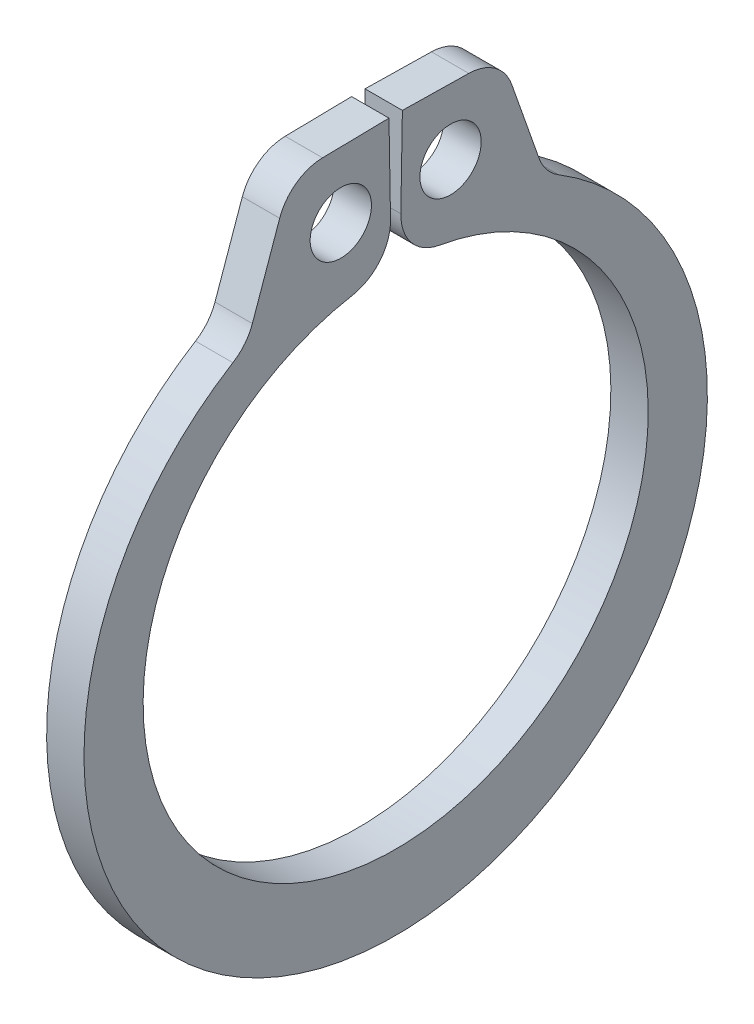
ISO-10303-21;
HEADER;
FILE_DESCRIPTION(('STEP AP214'),'2;1');
FILE_NAME('part.step','',(''),(''),'','','');
FILE_SCHEMA(('AUTOMOTIVE_DESIGN { 1 0 10303 214 1 1 1 1 }'));
ENDSEC;
DATA;
#1=APPLICATION_CONTEXT('core data for automotive mechanical design processes');
#2=APPLICATION_PROTOCOL_DEFINITION('international standard','automotive_design',2000,#1);
#3=PRODUCT_CONTEXT('',#1,'mechanical');
#4=PRODUCT('Part','Part','',(#3));
#5=PRODUCT_RELATED_PRODUCT_CATEGORY('part','',(#4));
#6=PRODUCT_DEFINITION_FORMATION('','',#4);
#7=PRODUCT_DEFINITION_CONTEXT('part definition',#1,'design');
#8=PRODUCT_DEFINITION('design','',#6,#7);
#9=PRODUCT_DEFINITION_SHAPE('','',#8);
#10=(LENGTH_UNIT() NAMED_UNIT(*) SI_UNIT(.MILLI.,.METRE.));
#11=(NAMED_UNIT(*) PLANE_ANGLE_UNIT() SI_UNIT($,.RADIAN.));
#12=(NAMED_UNIT(*) SI_UNIT($,.STERADIAN.) SOLID_ANGLE_UNIT());
#13=UNCERTAINTY_MEASURE_WITH_UNIT(LENGTH_MEASURE(1.E-05),#10,'distance_accuracy_value','');
#14=(GEOMETRIC_REPRESENTATION_CONTEXT(3) GLOBAL_UNCERTAINTY_ASSIGNED_CONTEXT((#13)) GLOBAL_UNIT_ASSIGNED_CONTEXT((#10,
#11,#12)) REPRESENTATION_CONTEXT('',''));
#15=CARTESIAN_POINT('',(0.,0.,0.));
#16=DIRECTION('',(0.,0.,1.));
#17=DIRECTION('',(1.,0.,0.));
#18=AXIS2_PLACEMENT_3D('',#15,#16,#17);
#19=CARTESIAN_POINT('',(0.3175,-0.264524901465114,0.));
#20=DIRECTION('',(1.,0.,0.));
#21=DIRECTION('',(0.,0.,-1.));
#22=AXIS2_PLACEMENT_3D('',#19,#20,#21);
#23=PLANE('',#22);
#24=CARTESIAN_POINT('',(0.3175,5.39474739325938,0.932493347387079));
#25=DIRECTION('',(1.,0.,0.));
#26=DIRECTION('',(0.,0.,-1.));
#27=AXIS2_PLACEMENT_3D('',#24,#25,#26);
#28=CIRCLE('',#27,0.5207);
#29=CARTESIAN_POINT('',(0.3175,5.39474739325938,0.411793347387079));
#30=VERTEX_POINT('',#29);
#31=EDGE_CURVE('E179',#30,#30,#28,.T.);
#32=ORIENTED_EDGE('',*,*,#31,.F.);
#33=EDGE_LOOP('',(#32));
#34=FACE_BOUND('',#33,.T.);
#35=DIRECTION('',(0.,0.943255355198257,0.332068268417521));
#36=VECTOR('',#35,1.);
#37=CARTESIAN_POINT('',(0.3175,6.49754857029043,-1.79007049490147));
#38=LINE('',#37,#36);
#39=CARTESIAN_POINT('',(0.3175,4.66344515220108,-2.43575731002226));
#40=VERTEX_POINT('',#39);
#41=CARTESIAN_POINT('',(0.3175,5.98129100900124,-1.97181635352819));
#42=VERTEX_POINT('',#41);
#43=EDGE_CURVE('E185',#40,#42,#38,.T.);
#44=ORIENTED_EDGE('',*,*,#43,.T.);
#45=CARTESIAN_POINT('',(0.3175,5.71982045444928,-1.22909708684508));
#46=DIRECTION('',(1.,0.,0.));
#47=DIRECTION('',(0.,0.,-1.));
#48=AXIS2_PLACEMENT_3D('',#45,#46,#47);
#49=CIRCLE('',#48,0.7874);
#50=CARTESIAN_POINT('',(0.3175,6.50710052961543,-1.2428391116738));
#51=VERTEX_POINT('',#50);
#52=EDGE_CURVE('E224',#42,#51,#49,.T.);
#53=ORIENTED_EDGE('',*,*,#52,.T.);
#54=DIRECTION('',(0.,0.0174524064372838,0.999847695156391));
#55=VECTOR('',#54,1.);
#56=CARTESIAN_POINT('',(0.3175,6.52680578444189,-0.113925818741299));
#57=LINE('',#56,#55);
#58=CARTESIAN_POINT('',(0.3175,6.52680578444189,-0.113925818741299));
#59=VERTEX_POINT('',#58);
#60=EDGE_CURVE('E188',#51,#59,#57,.T.);
#61=ORIENTED_EDGE('',*,*,#60,.T.);
#62=DIRECTION('',(0.,-0.999847695156391,0.0174524064372837));
#63=VECTOR('',#62,1.);
#64=CARTESIAN_POINT('',(0.3175,4.29194621622833,-0.0749161998726827));
#65=LINE('',#64,#63);
#66=CARTESIAN_POINT('',(0.3175,5.01784114958208,-0.0875867430654367));
#67=VERTEX_POINT('',#66);
#68=EDGE_CURVE('E156',#59,#67,#65,.T.);
#69=ORIENTED_EDGE('',*,*,#68,.T.);
#70=CARTESIAN_POINT('',(0.3175,5.00409912475336,-0.874866818231579));
#71=DIRECTION('',(1.,0.,0.));
#72=DIRECTION('',(0.,0.,-1.));
#73=AXIS2_PLACEMENT_3D('',#70,#71,#72);
#74=CIRCLE('',#73,0.7874);
#75=CARTESIAN_POINT('',(0.3175,4.22846376041659,-0.739262461405685));
#76=VERTEX_POINT('',#75);
#77=EDGE_CURVE('E222',#67,#76,#74,.T.);
#78=ORIENTED_EDGE('',*,*,#77,.T.);
#79=CARTESIAN_POINT('',(0.3175,0.,0.));
#80=DIRECTION('',(-1.,0.,0.));
#81=DIRECTION('',(0.,0.,-1.));
#82=AXIS2_PLACEMENT_3D('',#79,#80,#81);
#83=CIRCLE('',#82,4.2926);
#84=CARTESIAN_POINT('',(0.3175,4.22846376041659,0.739262461405685));
#85=VERTEX_POINT('',#84);
#86=EDGE_CURVE('E191',#76,#85,#83,.T.);
#87=ORIENTED_EDGE('',*,*,#86,.T.);
#88=CARTESIAN_POINT('',(0.3175,5.00409912475336,0.874866818231579));
#89=DIRECTION('',(1.,0.,0.));
#90=DIRECTION('',(0.,0.,-1.));
#91=AXIS2_PLACEMENT_3D('',#88,#89,#90);
#92=CIRCLE('',#91,0.7874);
#93=CARTESIAN_POINT('',(0.3175,5.01784114958208,0.087586743065437));
#94=VERTEX_POINT('',#93);
#95=EDGE_CURVE('E220',#85,#94,#92,.T.);
#96=ORIENTED_EDGE('',*,*,#95,.T.);
#97=DIRECTION('',(0.,0.999847695156391,0.0174524064372835));
#98=VECTOR('',#97,1.);
#99=CARTESIAN_POINT('',(0.3175,4.29194621622833,0.0749161998726831));
#100=LINE('',#99,#98);
#101=CARTESIAN_POINT('',(0.3175,6.52680578444189,0.113925818741299));
#102=VERTEX_POINT('',#101);
#103=EDGE_CURVE('E194',#94,#102,#100,.T.);
#104=ORIENTED_EDGE('',*,*,#103,.T.);
#105=DIRECTION('',(0.,-0.0174524064372838,0.999847695156391));
#106=VECTOR('',#105,1.);
#107=CARTESIAN_POINT('',(0.3175,6.52680578444189,0.113925818741299));
#108=LINE('',#107,#106);
#109=CARTESIAN_POINT('',(0.3175,6.50710052961543,1.2428391116738));
#110=VERTEX_POINT('',#109);
#111=EDGE_CURVE('E196',#102,#110,#108,.T.);
#112=ORIENTED_EDGE('',*,*,#111,.T.);
#113=CARTESIAN_POINT('',(0.3175,5.71982045444928,1.22909708684508));
#114=DIRECTION('',(1.,0.,0.));
#115=DIRECTION('',(0.,0.,-1.));
#116=AXIS2_PLACEMENT_3D('',#113,#114,#115);
#117=CIRCLE('',#116,0.7874);
#118=CARTESIAN_POINT('',(0.3175,5.98129100900124,1.97181635352819));
#119=VERTEX_POINT('',#118);
#120=EDGE_CURVE('E57',#110,#119,#117,.T.);
#121=ORIENTED_EDGE('',*,*,#120,.T.);
#122=DIRECTION('',(0.,-0.943255355198257,0.33206826841752));
#123=VECTOR('',#122,1.);
#124=CARTESIAN_POINT('',(0.3175,6.49754857029043,1.79007049490147));
#125=LINE('',#124,#123);
#126=CARTESIAN_POINT('',(0.3175,4.66344515220108,2.43575731002226));
#127=VERTEX_POINT('',#126);
#128=EDGE_CURVE('E198',#119,#127,#125,.T.);
#129=ORIENTED_EDGE('',*,*,#128,.T.);
#130=CARTESIAN_POINT('',(0.3175,4.92491570675304,3.17847657670536));
#131=DIRECTION('',(1.,0.,0.));
#132=DIRECTION('',(0.,0.,-1.));
#133=AXIS2_PLACEMENT_3D('',#130,#131,#132);
#134=CIRCLE('',#133,0.7874);
#135=CARTESIAN_POINT('',(0.3175,4.25345366496525,2.76721329553602));
#136=VERTEX_POINT('',#135);
#137=EDGE_CURVE('E11',#127,#136,#134,.F.);
#138=ORIENTED_EDGE('',*,*,#137,.T.);
#139=CARTESIAN_POINT('',(0.3175,-0.264524901465114,0.));
#140=DIRECTION('',(1.,0.,0.));
#141=DIRECTION('',(0.,0.,-1.));
#142=AXIS2_PLACEMENT_3D('',#139,#140,#141);
#143=CIRCLE('',#142,5.29807509853489);
#144=CARTESIAN_POINT('',(0.3175,4.25345366496525,-2.76721329553602));
#145=VERTEX_POINT('',#144);
#146=EDGE_CURVE('E182',#136,#145,#143,.T.);
#147=ORIENTED_EDGE('',*,*,#146,.T.);
#148=CARTESIAN_POINT('',(0.3175,4.92491570675304,-3.17847657670536));
#149=DIRECTION('',(1.,0.,0.));
#150=DIRECTION('',(0.,0.,-1.));
#151=AXIS2_PLACEMENT_3D('',#148,#149,#150);
#152=CIRCLE('',#151,0.7874);
#153=EDGE_CURVE('E244',#145,#40,#152,.F.);
#154=ORIENTED_EDGE('',*,*,#153,.T.);
#155=EDGE_LOOP('',(#44,#53,#61,#69,#78,#87,#96,#104,#112,#121,#129,#138,#147,#154));
#156=FACE_BOUND('',#155,.T.);
#157=CARTESIAN_POINT('',(0.3175,5.39474739325938,-0.932493347387079));
#158=DIRECTION('',(1.,0.,0.));
#159=DIRECTION('',(0.,0.,-1.));
#160=AXIS2_PLACEMENT_3D('',#157,#158,#159);
#161=CIRCLE('',#160,0.5207);
#162=CARTESIAN_POINT('',(0.3175,5.39474739325938,-1.45319334738708));
#163=VERTEX_POINT('',#162);
#164=EDGE_CURVE('E176',#163,#163,#161,.T.);
#165=ORIENTED_EDGE('',*,*,#164,.F.);
#166=EDGE_LOOP('',(#165));
#167=FACE_BOUND('',#166,.T.);
#168=ADVANCED_FACE('F35',(#34,#156,#167),#23,.T.);
#169=CARTESIAN_POINT('',(0.3175,-0.264524901465114,0.));
#170=DIRECTION('',(-1.,0.,0.));
#171=DIRECTION('',(0.,0.,1.));
#172=AXIS2_PLACEMENT_3D('',#169,#170,#171);
#173=CYLINDRICAL_SURFACE('',#172,5.29807509853489);
#174=CARTESIAN_POINT('',(-0.3175,-0.264524901465114,0.));
#175=DIRECTION('',(1.,0.,0.));
#176=DIRECTION('',(0.,0.,-1.));
#177=AXIS2_PLACEMENT_3D('',#174,#175,#176);
#178=CIRCLE('',#177,5.29807509853489);
#179=CARTESIAN_POINT('',(-0.3175,4.25345366496525,2.76721329553602));
#180=VERTEX_POINT('',#179);
#181=CARTESIAN_POINT('',(-0.3175,4.25345366496525,-2.76721329553602));
#182=VERTEX_POINT('',#181);
#183=EDGE_CURVE('E248',#180,#182,#178,.T.);
#184=ORIENTED_EDGE('',*,*,#183,.T.);
#185=DIRECTION('',(-1.,0.,0.));
#186=VECTOR('',#185,1.);
#187=CARTESIAN_POINT('',(0.3175,4.25345366496525,-2.76721329553602));
#188=LINE('',#187,#186);
#189=EDGE_CURVE('E209',#182,#145,#188,.F.);
#190=ORIENTED_EDGE('',*,*,#189,.T.);
#191=ORIENTED_EDGE('',*,*,#146,.F.);
#192=DIRECTION('',(-1.,0.,0.));
#193=VECTOR('',#192,1.);
#194=CARTESIAN_POINT('',(0.3175,4.25345366496525,2.76721329553602));
#195=LINE('',#194,#193);
#196=EDGE_CURVE('E206',#136,#180,#195,.T.);
#197=ORIENTED_EDGE('',*,*,#196,.T.);
#198=EDGE_LOOP('',(#184,#190,#191,#197));
#199=FACE_BOUND('',#198,.T.);
#200=ADVANCED_FACE('F258',(#199),#173,.T.);
#201=CARTESIAN_POINT('',(0.3175,6.49754857029043,-1.79007049490147));
#202=DIRECTION('',(0.,-0.332068268417521,0.943255355198257));
#203=DIRECTION('',(0.,-0.943255355198257,-0.332068268417521));
#204=AXIS2_PLACEMENT_3D('',#201,#202,#203);
#205=PLANE('',#204);
#206=ORIENTED_EDGE('',*,*,#43,.F.);
#207=DIRECTION('',(1.,0.,0.));
#208=VECTOR('',#207,1.);
#209=CARTESIAN_POINT('',(-0.3175,4.66344515220108,-2.43575731002226));
#210=LINE('',#209,#208);
#211=CARTESIAN_POINT('',(-0.3175,4.66344515220108,-2.43575731002226));
#212=VERTEX_POINT('',#211);
#213=EDGE_CURVE('E203',#40,#212,#210,.F.);
#214=ORIENTED_EDGE('',*,*,#213,.T.);
#215=DIRECTION('',(0.,0.943255355198257,0.332068268417521));
#216=VECTOR('',#215,1.);
#217=CARTESIAN_POINT('',(-0.3175,6.49754857029043,-1.79007049490147));
#218=LINE('',#217,#216);
#219=CARTESIAN_POINT('',(-0.3175,5.98129100900124,-1.97181635352819));
#220=VERTEX_POINT('',#219);
#221=EDGE_CURVE('E149',#212,#220,#218,.T.);
#222=ORIENTED_EDGE('',*,*,#221,.T.);
#223=DIRECTION('',(-1.,0.,0.));
#224=VECTOR('',#223,1.);
#225=CARTESIAN_POINT('',(0.3175,5.98129100900124,-1.97181635352819));
#226=LINE('',#225,#224);
#227=EDGE_CURVE('E157',#220,#42,#226,.F.);
#228=ORIENTED_EDGE('',*,*,#227,.T.);
#229=EDGE_LOOP('',(#206,#214,#222,#228));
#230=FACE_BOUND('',#229,.T.);
#231=ADVANCED_FACE('F266',(#230),#205,.F.);
#232=CARTESIAN_POINT('',(0.3175,6.52680578444189,-0.113925818741299));
#233=DIRECTION('',(0.,-0.999847695156391,0.0174524064372838));
#234=DIRECTION('',(0.,-0.0174524064372838,-0.999847695156391));
#235=AXIS2_PLACEMENT_3D('',#232,#233,#234);
#236=PLANE('',#235);
#237=ORIENTED_EDGE('',*,*,#60,.F.);
#238=DIRECTION('',(-1.,0.,0.));
#239=VECTOR('',#238,1.);
#240=CARTESIAN_POINT('',(0.3175,6.50710052961543,-1.2428391116738));
#241=LINE('',#240,#239);
#242=CARTESIAN_POINT('',(-0.3175,6.50710052961543,-1.2428391116738));
#243=VERTEX_POINT('',#242);
#244=EDGE_CURVE('E145',#51,#243,#241,.T.);
#245=ORIENTED_EDGE('',*,*,#244,.T.);
#246=DIRECTION('',(0.,0.0174524064372838,0.999847695156391));
#247=VECTOR('',#246,1.);
#248=CARTESIAN_POINT('',(-0.3175,6.52680578444189,-0.113925818741299));
#249=LINE('',#248,#247);
#250=CARTESIAN_POINT('',(-0.3175,6.52680578444189,-0.113925818741299));
#251=VERTEX_POINT('',#250);
#252=EDGE_CURVE('E138',#243,#251,#249,.T.);
#253=ORIENTED_EDGE('',*,*,#252,.T.);
#254=DIRECTION('',(-1.,0.,0.));
#255=VECTOR('',#254,1.);
#256=CARTESIAN_POINT('',(0.3175,6.52680578444189,-0.113925818741299));
#257=LINE('',#256,#255);
#258=EDGE_CURVE('E142',#59,#251,#257,.T.);
#259=ORIENTED_EDGE('',*,*,#258,.F.);
#260=EDGE_LOOP('',(#237,#245,#253,#259));
#261=FACE_BOUND('',#260,.T.);
#262=ADVANCED_FACE('F141',(#261),#236,.F.);
#263=CARTESIAN_POINT('',(0.3175,4.29194621622833,-0.0749161998726827));
#264=DIRECTION('',(0.,-0.0174524064372837,-0.999847695156391));
#265=DIRECTION('',(0.,0.999847695156391,-0.0174524064372837));
#266=AXIS2_PLACEMENT_3D('',#263,#264,#265);
#267=PLANE('',#266);
#268=DIRECTION('',(0.,-0.999847695156391,0.0174524064372837));
#269=VECTOR('',#268,1.);
#270=CARTESIAN_POINT('',(-0.3175,4.29194621622833,-0.0749161998726827));
#271=LINE('',#270,#269);
#272=CARTESIAN_POINT('',(-0.3175,5.01784114958208,-0.0875867430654367));
#273=VERTEX_POINT('',#272);
#274=EDGE_CURVE('E148',#251,#273,#271,.T.);
#275=ORIENTED_EDGE('',*,*,#274,.T.);
#276=DIRECTION('',(-1.,0.,0.));
#277=VECTOR('',#276,1.);
#278=CARTESIAN_POINT('',(0.3175,5.01784114958208,-0.0875867430654367));
#279=LINE('',#278,#277);
#280=EDGE_CURVE('E231',#273,#67,#279,.F.);
#281=ORIENTED_EDGE('',*,*,#280,.T.);
#282=ORIENTED_EDGE('',*,*,#68,.F.);
#283=ORIENTED_EDGE('',*,*,#258,.T.);
#284=EDGE_LOOP('',(#275,#281,#282,#283));
#285=FACE_BOUND('',#284,.T.);
#286=ADVANCED_FACE('F153',(#285),#267,.F.);
#287=CARTESIAN_POINT('',(0.3175,0.,0.));
#288=DIRECTION('',(-1.,0.,0.));
#289=DIRECTION('',(0.,0.,1.));
#290=AXIS2_PLACEMENT_3D('',#287,#288,#289);
#291=CYLINDRICAL_SURFACE('',#290,4.2926);
#292=ORIENTED_EDGE('',*,*,#86,.F.);
#293=DIRECTION('',(-1.,0.,0.));
#294=VECTOR('',#293,1.);
#295=CARTESIAN_POINT('',(0.3175,4.22846376041659,-0.739262461405685));
#296=LINE('',#295,#294);
#297=CARTESIAN_POINT('',(-0.3175,4.22846376041659,-0.739262461405685));
#298=VERTEX_POINT('',#297);
#299=EDGE_CURVE('E228',#76,#298,#296,.T.);
#300=ORIENTED_EDGE('',*,*,#299,.T.);
#301=CARTESIAN_POINT('',(-0.3175,0.,0.));
#302=DIRECTION('',(-1.,0.,0.));
#303=DIRECTION('',(0.,0.,-1.));
#304=AXIS2_PLACEMENT_3D('',#301,#302,#303);
#305=CIRCLE('',#304,4.2926);
#306=CARTESIAN_POINT('',(-0.3175,4.22846376041659,0.739262461405685));
#307=VERTEX_POINT('',#306);
#308=EDGE_CURVE('E163',#298,#307,#305,.T.);
#309=ORIENTED_EDGE('',*,*,#308,.T.);
#310=DIRECTION('',(-1.,0.,0.));
#311=VECTOR('',#310,1.);
#312=CARTESIAN_POINT('',(0.3175,4.22846376041659,0.739262461405685));
#313=LINE('',#312,#311);
#314=EDGE_CURVE('E226',#307,#85,#313,.F.);
#315=ORIENTED_EDGE('',*,*,#314,.T.);
#316=EDGE_LOOP('',(#292,#300,#309,#315));
#317=FACE_BOUND('',#316,.T.);
#318=ADVANCED_FACE('F278',(#317),#291,.F.);
#319=CARTESIAN_POINT('',(0.3175,4.29194621622833,0.0749161998726831));
#320=DIRECTION('',(0.,-0.0174524064372835,0.999847695156391));
#321=DIRECTION('',(0.,-0.999847695156391,-0.0174524064372835));
#322=AXIS2_PLACEMENT_3D('',#319,#320,#321);
#323=PLANE('',#322);
#324=ORIENTED_EDGE('',*,*,#103,.F.);
#325=DIRECTION('',(-1.,0.,0.));
#326=VECTOR('',#325,1.);
#327=CARTESIAN_POINT('',(0.3175,5.01784114958208,0.087586743065437));
#328=LINE('',#327,#326);
#329=CARTESIAN_POINT('',(-0.3175,5.01784114958208,0.087586743065437));
#330=VERTEX_POINT('',#329);
#331=EDGE_CURVE('E233',#94,#330,#328,.T.);
#332=ORIENTED_EDGE('',*,*,#331,.T.);
#333=DIRECTION('',(0.,0.999847695156391,0.0174524064372835));
#334=VECTOR('',#333,1.);
#335=CARTESIAN_POINT('',(-0.3175,4.29194621622833,0.0749161998726831));
#336=LINE('',#335,#334);
#337=CARTESIAN_POINT('',(-0.3175,6.52680578444189,0.113925818741299));
#338=VERTEX_POINT('',#337);
#339=EDGE_CURVE('E166',#330,#338,#336,.T.);
#340=ORIENTED_EDGE('',*,*,#339,.T.);
#341=DIRECTION('',(-1.,0.,0.));
#342=VECTOR('',#341,1.);
#343=CARTESIAN_POINT('',(0.3175,6.52680578444189,0.113925818741299));
#344=LINE('',#343,#342);
#345=EDGE_CURVE('E158',#102,#338,#344,.T.);
#346=ORIENTED_EDGE('',*,*,#345,.F.);
#347=EDGE_LOOP('',(#324,#332,#340,#346));
#348=FACE_BOUND('',#347,.T.);
#349=ADVANCED_FACE('F288',(#348),#323,.F.);
#350=CARTESIAN_POINT('',(0.3175,6.52680578444189,0.113925818741299));
#351=DIRECTION('',(0.,-0.999847695156391,-0.0174524064372838));
#352=DIRECTION('',(0.,0.0174524064372838,-0.999847695156391));
#353=AXIS2_PLACEMENT_3D('',#350,#351,#352);
#354=PLANE('',#353);
#355=DIRECTION('',(0.,-0.0174524064372838,0.999847695156391));
#356=VECTOR('',#355,1.);
#357=CARTESIAN_POINT('',(-0.3175,6.52680578444189,0.113925818741299));
#358=LINE('',#357,#356);
#359=CARTESIAN_POINT('',(-0.3175,6.50710052961543,1.2428391116738));
#360=VERTEX_POINT('',#359);
#361=EDGE_CURVE('E171',#338,#360,#358,.T.);
#362=ORIENTED_EDGE('',*,*,#361,.T.);
#363=DIRECTION('',(-1.,0.,0.));
#364=VECTOR('',#363,1.);
#365=CARTESIAN_POINT('',(0.3175,6.50710052961543,1.2428391116738));
#366=LINE('',#365,#364);
#367=EDGE_CURVE('E240',#360,#110,#366,.F.);
#368=ORIENTED_EDGE('',*,*,#367,.T.);
#369=ORIENTED_EDGE('',*,*,#111,.F.);
#370=ORIENTED_EDGE('',*,*,#345,.T.);
#371=EDGE_LOOP('',(#362,#368,#369,#370));
#372=FACE_BOUND('',#371,.T.);
#373=ADVANCED_FACE('F295',(#372),#354,.F.);
#374=CARTESIAN_POINT('',(0.3175,6.49754857029043,1.79007049490147));
#375=DIRECTION('',(0.,-0.33206826841752,-0.943255355198257));
#376=DIRECTION('',(0.,0.943255355198257,-0.332068268417521));
#377=AXIS2_PLACEMENT_3D('',#374,#375,#376);
#378=PLANE('',#377);
#379=ORIENTED_EDGE('',*,*,#128,.F.);
#380=DIRECTION('',(-1.,0.,0.));
#381=VECTOR('',#380,1.);
#382=CARTESIAN_POINT('',(0.3175,5.98129100900124,1.97181635352819));
#383=LINE('',#382,#381);
#384=CARTESIAN_POINT('',(-0.3175,5.98129100900124,1.97181635352819));
#385=VERTEX_POINT('',#384);
#386=EDGE_CURVE('E237',#119,#385,#383,.T.);
#387=ORIENTED_EDGE('',*,*,#386,.T.);
#388=DIRECTION('',(0.,-0.943255355198257,0.33206826841752));
#389=VECTOR('',#388,1.);
#390=CARTESIAN_POINT('',(-0.3175,6.49754857029043,1.79007049490147));
#391=LINE('',#390,#389);
#392=CARTESIAN_POINT('',(-0.3175,4.66344515220108,2.43575731002226));
#393=VERTEX_POINT('',#392);
#394=EDGE_CURVE('E174',#385,#393,#391,.T.);
#395=ORIENTED_EDGE('',*,*,#394,.T.);
#396=DIRECTION('',(1.,0.,0.));
#397=VECTOR('',#396,1.);
#398=CARTESIAN_POINT('',(0.3175,4.66344515220108,2.43575731002226));
#399=LINE('',#398,#397);
#400=EDGE_CURVE('E50',#393,#127,#399,.T.);
#401=ORIENTED_EDGE('',*,*,#400,.T.);
#402=EDGE_LOOP('',(#379,#387,#395,#401));
#403=FACE_BOUND('',#402,.T.);
#404=ADVANCED_FACE('F251',(#403),#378,.F.);
#405=CARTESIAN_POINT('',(0.3175,5.39474739325938,0.932493347387079));
#406=DIRECTION('',(-1.,0.,0.));
#407=DIRECTION('',(0.,0.,1.));
#408=AXIS2_PLACEMENT_3D('',#405,#406,#407);
#409=CYLINDRICAL_SURFACE('',#408,0.5207);
#410=ORIENTED_EDGE('',*,*,#31,.T.);
#411=EDGE_LOOP('',(#410));
#412=FACE_BOUND('',#411,.T.);
#413=CARTESIAN_POINT('',(-0.3175,5.39474739325938,0.932493347387079));
#414=DIRECTION('',(1.,0.,0.));
#415=DIRECTION('',(0.,0.,-1.));
#416=AXIS2_PLACEMENT_3D('',#413,#414,#415);
#417=CIRCLE('',#416,0.5207);
#418=CARTESIAN_POINT('',(-0.3175,5.39474739325938,0.411793347387079));
#419=VERTEX_POINT('',#418);
#420=EDGE_CURVE('E333',#419,#419,#417,.T.);
#421=ORIENTED_EDGE('',*,*,#420,.F.);
#422=EDGE_LOOP('',(#421));
#423=FACE_BOUND('',#422,.T.);
#424=ADVANCED_FACE('F302',(#412,#423),#409,.F.);
#425=CARTESIAN_POINT('',(0.3175,5.39474739325938,-0.932493347387079));
#426=DIRECTION('',(-1.,0.,0.));
#427=DIRECTION('',(0.,0.,1.));
#428=AXIS2_PLACEMENT_3D('',#425,#426,#427);
#429=CYLINDRICAL_SURFACE('',#428,0.5207);
#430=ORIENTED_EDGE('',*,*,#164,.T.);
#431=EDGE_LOOP('',(#430));
#432=FACE_BOUND('',#431,.T.);
#433=CARTESIAN_POINT('',(-0.3175,5.39474739325938,-0.932493347387079));
#434=DIRECTION('',(1.,0.,0.));
#435=DIRECTION('',(0.,0.,-1.));
#436=AXIS2_PLACEMENT_3D('',#433,#434,#435);
#437=CIRCLE('',#436,0.5207);
#438=CARTESIAN_POINT('',(-0.3175,5.39474739325938,-1.45319334738708));
#439=VERTEX_POINT('',#438);
#440=EDGE_CURVE('E330',#439,#439,#437,.T.);
#441=ORIENTED_EDGE('',*,*,#440,.F.);
#442=EDGE_LOOP('',(#441));
#443=FACE_BOUND('',#442,.T.);
#444=ADVANCED_FACE('F316',(#432,#443),#429,.F.);
#445=CARTESIAN_POINT('',(-0.3175,-0.264524901465114,0.));
#446=DIRECTION('',(1.,0.,0.));
#447=DIRECTION('',(0.,0.,-1.));
#448=AXIS2_PLACEMENT_3D('',#445,#446,#447);
#449=PLANE('',#448);
#450=ORIENTED_EDGE('',*,*,#440,.T.);
#451=EDGE_LOOP('',(#450));
#452=FACE_BOUND('',#451,.T.);
#453=ORIENTED_EDGE('',*,*,#420,.T.);
#454=EDGE_LOOP('',(#453));
#455=FACE_BOUND('',#454,.T.);
#456=ORIENTED_EDGE('',*,*,#252,.F.);
#457=CARTESIAN_POINT('',(-0.3175,5.71982045444928,-1.22909708684508));
#458=DIRECTION('',(1.,0.,0.));
#459=DIRECTION('',(0.,0.,-1.));
#460=AXIS2_PLACEMENT_3D('',#457,#458,#459);
#461=CIRCLE('',#460,0.7874);
#462=EDGE_CURVE('E217',#243,#220,#461,.F.);
#463=ORIENTED_EDGE('',*,*,#462,.T.);
#464=ORIENTED_EDGE('',*,*,#221,.F.);
#465=CARTESIAN_POINT('',(-0.3175,4.92491570675304,-3.17847657670536));
#466=DIRECTION('',(1.,0.,0.));
#467=DIRECTION('',(0.,0.,-1.));
#468=AXIS2_PLACEMENT_3D('',#465,#466,#467);
#469=CIRCLE('',#468,0.7874);
#470=EDGE_CURVE('E242',#212,#182,#469,.T.);
#471=ORIENTED_EDGE('',*,*,#470,.T.);
#472=ORIENTED_EDGE('',*,*,#183,.F.);
#473=CARTESIAN_POINT('',(-0.3175,4.92491570675304,3.17847657670536));
#474=DIRECTION('',(1.,0.,0.));
#475=DIRECTION('',(0.,0.,-1.));
#476=AXIS2_PLACEMENT_3D('',#473,#474,#475);
#477=CIRCLE('',#476,0.7874);
#478=EDGE_CURVE('E43',#180,#393,#477,.T.);
#479=ORIENTED_EDGE('',*,*,#478,.T.);
#480=ORIENTED_EDGE('',*,*,#394,.F.);
#481=CARTESIAN_POINT('',(-0.3175,5.71982045444928,1.22909708684508));
#482=DIRECTION('',(1.,0.,0.));
#483=DIRECTION('',(0.,0.,-1.));
#484=AXIS2_PLACEMENT_3D('',#481,#482,#483);
#485=CIRCLE('',#484,0.7874);
#486=EDGE_CURVE('E212',#385,#360,#485,.F.);
#487=ORIENTED_EDGE('',*,*,#486,.T.);
#488=ORIENTED_EDGE('',*,*,#361,.F.);
#489=ORIENTED_EDGE('',*,*,#339,.F.);
#490=CARTESIAN_POINT('',(-0.3175,5.00409912475336,0.874866818231579));
#491=DIRECTION('',(1.,0.,0.));
#492=DIRECTION('',(0.,0.,-1.));
#493=AXIS2_PLACEMENT_3D('',#490,#491,#492);
#494=CIRCLE('',#493,0.7874);
#495=EDGE_CURVE('E214',#330,#307,#494,.F.);
#496=ORIENTED_EDGE('',*,*,#495,.T.);
#497=ORIENTED_EDGE('',*,*,#308,.F.);
#498=CARTESIAN_POINT('',(-0.3175,5.00409912475336,-0.874866818231579));
#499=DIRECTION('',(1.,0.,0.));
#500=DIRECTION('',(0.,0.,-1.));
#501=AXIS2_PLACEMENT_3D('',#498,#499,#500);
#502=CIRCLE('',#501,0.7874);
#503=EDGE_CURVE('E162',#298,#273,#502,.F.);
#504=ORIENTED_EDGE('',*,*,#503,.T.);
#505=ORIENTED_EDGE('',*,*,#274,.F.);
#506=EDGE_LOOP('',(#456,#463,#464,#471,#472,#479,#480,#487,#488,#489,#496,#497,#504,#505));
#507=FACE_BOUND('',#506,.T.);
#508=ADVANCED_FACE('F160',(#452,#455,#507),#449,.F.);
#509=CARTESIAN_POINT('',(0.3175,4.92491570675304,-3.17847657670536));
#510=DIRECTION('',(-1.,0.,0.));
#511=DIRECTION('',(0.,0.,1.));
#512=AXIS2_PLACEMENT_3D('',#509,#510,#511);
#513=CYLINDRICAL_SURFACE('',#512,0.7874);
#514=ORIENTED_EDGE('',*,*,#153,.F.);
#515=ORIENTED_EDGE('',*,*,#189,.F.);
#516=ORIENTED_EDGE('',*,*,#470,.F.);
#517=ORIENTED_EDGE('',*,*,#213,.F.);
#518=EDGE_LOOP('',(#514,#515,#516,#517));
#519=FACE_BOUND('',#518,.T.);
#520=ADVANCED_FACE('F261',(#519),#513,.F.);
#521=CARTESIAN_POINT('',(0.3175,5.71982045444928,-1.22909708684508));
#522=DIRECTION('',(-1.,0.,0.));
#523=DIRECTION('',(0.,0.,1.));
#524=AXIS2_PLACEMENT_3D('',#521,#522,#523);
#525=CYLINDRICAL_SURFACE('',#524,0.7874);
#526=ORIENTED_EDGE('',*,*,#52,.F.);
#527=ORIENTED_EDGE('',*,*,#227,.F.);
#528=ORIENTED_EDGE('',*,*,#462,.F.);
#529=ORIENTED_EDGE('',*,*,#244,.F.);
#530=EDGE_LOOP('',(#526,#527,#528,#529));
#531=FACE_BOUND('',#530,.T.);
#532=ADVANCED_FACE('F271',(#531),#525,.T.);
#533=CARTESIAN_POINT('',(0.3175,5.00409912475336,-0.874866818231579));
#534=DIRECTION('',(-1.,0.,0.));
#535=DIRECTION('',(0.,0.,1.));
#536=AXIS2_PLACEMENT_3D('',#533,#534,#535);
#537=CYLINDRICAL_SURFACE('',#536,0.7874);
#538=ORIENTED_EDGE('',*,*,#77,.F.);
#539=ORIENTED_EDGE('',*,*,#280,.F.);
#540=ORIENTED_EDGE('',*,*,#503,.F.);
#541=ORIENTED_EDGE('',*,*,#299,.F.);
#542=EDGE_LOOP('',(#538,#539,#540,#541));
#543=FACE_BOUND('',#542,.T.);
#544=ADVANCED_FACE('F276',(#543),#537,.T.);
#545=CARTESIAN_POINT('',(0.3175,5.00409912475336,0.874866818231579));
#546=DIRECTION('',(-1.,0.,0.));
#547=DIRECTION('',(0.,0.,1.));
#548=AXIS2_PLACEMENT_3D('',#545,#546,#547);
#549=CYLINDRICAL_SURFACE('',#548,0.7874);
#550=ORIENTED_EDGE('',*,*,#95,.F.);
#551=ORIENTED_EDGE('',*,*,#314,.F.);
#552=ORIENTED_EDGE('',*,*,#495,.F.);
#553=ORIENTED_EDGE('',*,*,#331,.F.);
#554=EDGE_LOOP('',(#550,#551,#552,#553));
#555=FACE_BOUND('',#554,.T.);
#556=ADVANCED_FACE('F285',(#555),#549,.T.);
#557=CARTESIAN_POINT('',(0.3175,5.71982045444928,1.22909708684508));
#558=DIRECTION('',(-1.,0.,0.));
#559=DIRECTION('',(0.,0.,1.));
#560=AXIS2_PLACEMENT_3D('',#557,#558,#559);
#561=CYLINDRICAL_SURFACE('',#560,0.7874);
#562=ORIENTED_EDGE('',*,*,#120,.F.);
#563=ORIENTED_EDGE('',*,*,#367,.F.);
#564=ORIENTED_EDGE('',*,*,#486,.F.);
#565=ORIENTED_EDGE('',*,*,#386,.F.);
#566=EDGE_LOOP('',(#562,#563,#564,#565));
#567=FACE_BOUND('',#566,.T.);
#568=ADVANCED_FACE('F294',(#567),#561,.T.);
#569=CARTESIAN_POINT('',(0.3175,4.92491570675304,3.17847657670536));
#570=DIRECTION('',(-1.,0.,0.));
#571=DIRECTION('',(0.,0.,1.));
#572=AXIS2_PLACEMENT_3D('',#569,#570,#571);
#573=CYLINDRICAL_SURFACE('',#572,0.7874);
#574=ORIENTED_EDGE('',*,*,#137,.F.);
#575=ORIENTED_EDGE('',*,*,#400,.F.);
#576=ORIENTED_EDGE('',*,*,#478,.F.);
#577=ORIENTED_EDGE('',*,*,#196,.F.);
#578=EDGE_LOOP('',(#574,#575,#576,#577));
#579=FACE_BOUND('',#578,.T.);
#580=ADVANCED_FACE('F37',(#579),#573,.F.);
#581=CLOSED_SHELL('',(#168,#200,#231,#262,#286,#318,#349,#373,#404,#424,#444,#508,#520,#532,
#544,#556,#568,#580));
#582=MANIFOLD_SOLID_BREP('B2',#581);
#583=ADVANCED_BREP_SHAPE_REPRESENTATION('',(#18,#582),#14);
#584=SHAPE_DEFINITION_REPRESENTATION(#9,#583);
ENDSEC;
END-ISO-10303-21;
